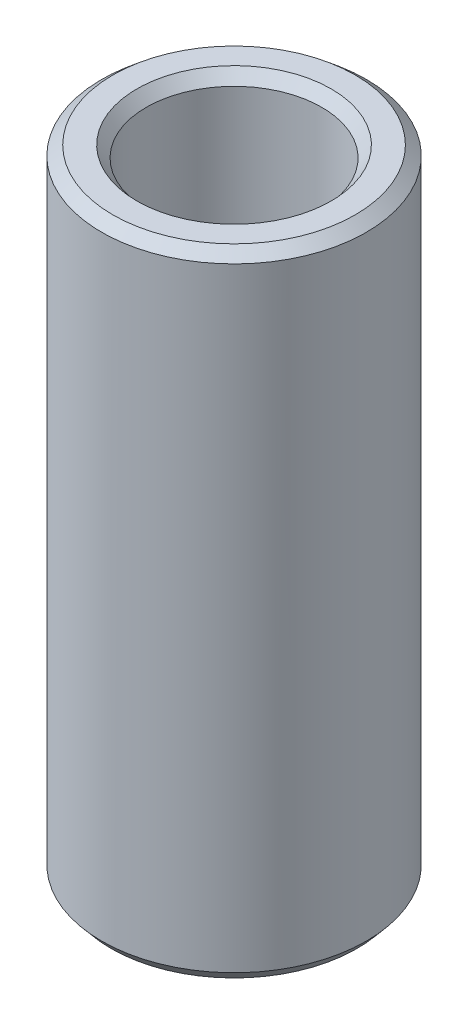
ISO-10303-21;
HEADER;
FILE_DESCRIPTION(('STEP AP214'),'2;1');
FILE_NAME('part.step','',(''),(''),'','','');
FILE_SCHEMA(('AUTOMOTIVE_DESIGN { 1 0 10303 214 1 1 1 1 }'));
ENDSEC;
DATA;
#1=APPLICATION_CONTEXT('core data for automotive mechanical design processes');
#2=APPLICATION_PROTOCOL_DEFINITION('international standard','automotive_design',2000,#1);
#3=PRODUCT_CONTEXT('',#1,'mechanical');
#4=PRODUCT('Part','Part','',(#3));
#5=PRODUCT_RELATED_PRODUCT_CATEGORY('part','',(#4));
#6=PRODUCT_DEFINITION_FORMATION('','',#4);
#7=PRODUCT_DEFINITION_CONTEXT('part definition',#1,'design');
#8=PRODUCT_DEFINITION('design','',#6,#7);
#9=PRODUCT_DEFINITION_SHAPE('','',#8);
#10=(LENGTH_UNIT() NAMED_UNIT(*) SI_UNIT(.MILLI.,.METRE.));
#11=(NAMED_UNIT(*) PLANE_ANGLE_UNIT() SI_UNIT($,.RADIAN.));
#12=(NAMED_UNIT(*) SI_UNIT($,.STERADIAN.) SOLID_ANGLE_UNIT());
#13=UNCERTAINTY_MEASURE_WITH_UNIT(LENGTH_MEASURE(1.E-05),#10,'distance_accuracy_value','');
#14=(GEOMETRIC_REPRESENTATION_CONTEXT(3) GLOBAL_UNCERTAINTY_ASSIGNED_CONTEXT((#13)) GLOBAL_UNIT_ASSIGNED_CONTEXT((#10,
#11,#12)) REPRESENTATION_CONTEXT('',''));
#15=CARTESIAN_POINT('',(0.,0.,0.));
#16=DIRECTION('',(0.,0.,1.));
#17=DIRECTION('',(1.,0.,0.));
#18=AXIS2_PLACEMENT_3D('',#15,#16,#17);
#19=CARTESIAN_POINT('',(0.,239.631027816616,0.));
#20=DIRECTION('',(0.,-1.,0.));
#21=DIRECTION('',(0.,0.,-1.));
#22=AXIS2_PLACEMENT_3D('',#19,#20,#21);
#23=CYLINDRICAL_SURFACE('',#22,50.);
#24=CARTESIAN_POINT('',(0.,4.23667000761427,0.));
#25=DIRECTION('',(0.,1.,0.));
#26=DIRECTION('',(0.,0.,1.));
#27=AXIS2_PLACEMENT_3D('',#24,#25,#26);
#28=CIRCLE('',#27,50.);
#29=CARTESIAN_POINT('',(0.,4.23667000761427,50.));
#30=VERTEX_POINT('',#29);
#31=EDGE_CURVE('E10',#30,#30,#28,.T.);
#32=ORIENTED_EDGE('',*,*,#31,.T.);
#33=EDGE_LOOP('',(#32));
#34=FACE_BOUND('',#33,.T.);
#35=CARTESIAN_POINT('',(0.,236.068790785085,0.));
#36=DIRECTION('',(0.,1.,0.));
#37=DIRECTION('',(0.,0.,1.));
#38=AXIS2_PLACEMENT_3D('',#35,#36,#37);
#39=CIRCLE('',#38,50.);
#40=CARTESIAN_POINT('',(0.,236.068790785085,-50.));
#41=VERTEX_POINT('',#40);
#42=EDGE_CURVE('E50',#41,#41,#39,.F.);
#43=ORIENTED_EDGE('',*,*,#42,.T.);
#44=EDGE_LOOP('',(#43));
#45=FACE_BOUND('',#44,.T.);
#46=ADVANCED_FACE('F39',(#34,#45),#23,.T.);
#47=CARTESIAN_POINT('',(0.,239.631027816616,0.));
#48=DIRECTION('',(0.,1.,0.));
#49=DIRECTION('',(0.,0.,1.));
#50=AXIS2_PLACEMENT_3D('',#47,#48,#49);
#51=PLANE('',#50);
#52=CARTESIAN_POINT('',(0.,239.631027816616,0.));
#53=DIRECTION('',(0.,1.,0.));
#54=DIRECTION('',(0.,0.,1.));
#55=AXIS2_PLACEMENT_3D('',#52,#53,#54);
#56=CIRCLE('',#55,36.6933530759226);
#57=CARTESIAN_POINT('',(0.,239.631027816616,36.6933530759226));
#58=VERTEX_POINT('',#57);
#59=EDGE_CURVE('E58',#58,#58,#56,.F.);
#60=ORIENTED_EDGE('',*,*,#59,.T.);
#61=EDGE_LOOP('',(#60));
#62=FACE_BOUND('',#61,.T.);
#63=CARTESIAN_POINT('',(0.,239.631027816616,0.));
#64=DIRECTION('',(0.,1.,0.));
#65=DIRECTION('',(0.,0.,1.));
#66=AXIS2_PLACEMENT_3D('',#63,#64,#65);
#67=CIRCLE('',#66,45.7633299923858);
#68=CARTESIAN_POINT('',(0.,239.631027816616,-45.7633299923858));
#69=VERTEX_POINT('',#68);
#70=EDGE_CURVE('E61',#69,#69,#67,.T.);
#71=ORIENTED_EDGE('',*,*,#70,.T.);
#72=EDGE_LOOP('',(#71));
#73=FACE_BOUND('',#72,.T.);
#74=ADVANCED_FACE('F88',(#62,#73),#51,.T.);
#75=CARTESIAN_POINT('',(0.,0.,0.));
#76=DIRECTION('',(0.,1.,0.));
#77=DIRECTION('',(0.,0.,1.));
#78=AXIS2_PLACEMENT_3D('',#75,#76,#77);
#79=PLANE('',#78);
#80=CARTESIAN_POINT('',(0.,0.,0.));
#81=DIRECTION('',(0.,1.,0.));
#82=DIRECTION('',(0.,0.,1.));
#83=AXIS2_PLACEMENT_3D('',#80,#81,#82);
#84=CIRCLE('',#83,37.3677860520059);
#85=CARTESIAN_POINT('',(0.,0.,37.3677860520059));
#86=VERTEX_POINT('',#85);
#87=EDGE_CURVE('E51',#86,#86,#84,.T.);
#88=ORIENTED_EDGE('',*,*,#87,.T.);
#89=EDGE_LOOP('',(#88));
#90=FACE_BOUND('',#89,.T.);
#91=CARTESIAN_POINT('',(0.,0.,0.));
#92=DIRECTION('',(0.,1.,0.));
#93=DIRECTION('',(0.,0.,1.));
#94=AXIS2_PLACEMENT_3D('',#91,#92,#93);
#95=CIRCLE('',#94,46.437762968469);
#96=CARTESIAN_POINT('',(0.,0.,46.437762968469));
#97=VERTEX_POINT('',#96);
#98=EDGE_CURVE('E54',#97,#97,#95,.F.);
#99=ORIENTED_EDGE('',*,*,#98,.T.);
#100=EDGE_LOOP('',(#99));
#101=FACE_BOUND('',#100,.T.);
#102=ADVANCED_FACE('F83',(#90,#101),#79,.F.);
#103=CARTESIAN_POINT('',(0.,239.631027816616,0.));
#104=DIRECTION('',(0.,-1.,0.));
#105=DIRECTION('',(0.,0.,-1.));
#106=AXIS2_PLACEMENT_3D('',#103,#104,#105);
#107=CYLINDRICAL_SURFACE('',#106,33.1311160443917);
#108=CARTESIAN_POINT('',(0.,235.394357809001,0.));
#109=DIRECTION('',(0.,1.,0.));
#110=DIRECTION('',(0.,0.,1.));
#111=AXIS2_PLACEMENT_3D('',#108,#109,#110);
#112=CIRCLE('',#111,33.1311160443917);
#113=CARTESIAN_POINT('',(0.,235.394357809001,33.1311160443917));
#114=VERTEX_POINT('',#113);
#115=EDGE_CURVE('E67',#114,#114,#112,.T.);
#116=ORIENTED_EDGE('',*,*,#115,.T.);
#117=EDGE_LOOP('',(#116));
#118=FACE_BOUND('',#117,.T.);
#119=CARTESIAN_POINT('',(0.,3.56223703153102,0.));
#120=DIRECTION('',(0.,1.,0.));
#121=DIRECTION('',(0.,0.,1.));
#122=AXIS2_PLACEMENT_3D('',#119,#120,#121);
#123=CIRCLE('',#122,33.1311160443917);
#124=CARTESIAN_POINT('',(0.,3.56223703153102,33.1311160443917));
#125=VERTEX_POINT('',#124);
#126=EDGE_CURVE('E69',#125,#125,#123,.F.);
#127=ORIENTED_EDGE('',*,*,#126,.T.);
#128=EDGE_LOOP('',(#127));
#129=FACE_BOUND('',#128,.T.);
#130=ADVANCED_FACE('F71',(#118,#129),#107,.F.);
#131=CARTESIAN_POINT('',(0.,235.394357809001,0.));
#132=DIRECTION('',(0.,1.,0.));
#133=DIRECTION('',(0.,0.,1.));
#134=AXIS2_PLACEMENT_3D('',#131,#132,#133);
#135=CONICAL_SURFACE('',#134,33.1311160443917,0.699134890297728);
#136=ORIENTED_EDGE('',*,*,#59,.F.);
#137=EDGE_LOOP('',(#136));
#138=FACE_BOUND('',#137,.T.);
#139=ORIENTED_EDGE('',*,*,#115,.F.);
#140=EDGE_LOOP('',(#139));
#141=FACE_BOUND('',#140,.T.);
#142=ADVANCED_FACE('F77',(#138,#141),#135,.F.);
#143=CARTESIAN_POINT('',(0.,0.,0.));
#144=DIRECTION('',(0.,-1.,0.));
#145=DIRECTION('',(0.,0.,-1.));
#146=AXIS2_PLACEMENT_3D('',#143,#144,#145);
#147=CONICAL_SURFACE('',#146,37.3677860520059,0.871661436497165);
#148=ORIENTED_EDGE('',*,*,#126,.F.);
#149=EDGE_LOOP('',(#148));
#150=FACE_BOUND('',#149,.T.);
#151=ORIENTED_EDGE('',*,*,#87,.F.);
#152=EDGE_LOOP('',(#151));
#153=FACE_BOUND('',#152,.T.);
#154=ADVANCED_FACE('F73',(#150,#153),#147,.F.);
#155=CARTESIAN_POINT('',(0.,4.23667000761427,0.));
#156=DIRECTION('',(0.,1.,0.));
#157=DIRECTION('',(0.,0.,1.));
#158=AXIS2_PLACEMENT_3D('',#155,#156,#157);
#159=CONICAL_SURFACE('',#158,50.,0.699134890297727);
#160=ORIENTED_EDGE('',*,*,#98,.F.);
#161=EDGE_LOOP('',(#160));
#162=FACE_BOUND('',#161,.T.);
#163=ORIENTED_EDGE('',*,*,#31,.F.);
#164=EDGE_LOOP('',(#163));
#165=FACE_BOUND('',#164,.T.);
#166=ADVANCED_FACE('F76',(#162,#165),#159,.T.);
#167=CARTESIAN_POINT('',(0.,239.631027816616,0.));
#168=DIRECTION('',(0.,-1.,0.));
#169=DIRECTION('',(0.,0.,-1.));
#170=AXIS2_PLACEMENT_3D('',#167,#168,#169);
#171=CONICAL_SURFACE('',#170,45.7633299923858,0.871661436497164);
#172=CARTESIAN_POINT('',(0.,236.068790785085,-50.));
#173=CARTESIAN_POINT('',(0.,236.10589742083,-49.955868020754));
#174=CARTESIAN_POINT('',(0.,236.143004056575,-49.911736041508));
#175=CARTESIAN_POINT('',(0.,236.217217328065,-49.8234720830161));
#176=CARTESIAN_POINT('',(0.,236.25432396381,-49.7793401037701));
#177=CARTESIAN_POINT('',(0.,236.328537235301,-49.6910761452782));
#178=CARTESIAN_POINT('',(0.,236.365643871046,-49.6469441660322));
#179=CARTESIAN_POINT('',(0.,236.439857142536,-49.5586802075402));
#180=CARTESIAN_POINT('',(0.,236.476963778281,-49.5145482282942));
#181=CARTESIAN_POINT('',(0.,236.551177049771,-49.4262842698023));
#182=CARTESIAN_POINT('',(0.,236.588283685516,-49.3821522905563));
#183=CARTESIAN_POINT('',(0.,236.662496957007,-49.2938883320643));
#184=CARTESIAN_POINT('',(0.,236.699603592752,-49.2497563528183));
#185=CARTESIAN_POINT('',(0.,236.773816864242,-49.1614923943264));
#186=CARTESIAN_POINT('',(0.,236.810923499987,-49.1173604150804));
#187=CARTESIAN_POINT('',(0.,236.885136771477,-49.0290964565884));
#188=CARTESIAN_POINT('',(0.,236.922243407222,-48.9849644773425));
#189=CARTESIAN_POINT('',(0.,236.996456678713,-48.8967005188505));
#190=CARTESIAN_POINT('',(0.,237.033563314458,-48.8525685396045));
#191=CARTESIAN_POINT('',(0.,237.107776585948,-48.7643045811126));
#192=CARTESIAN_POINT('',(0.,237.144883221693,-48.7201726018666));
#193=CARTESIAN_POINT('',(0.,237.219096493183,-48.6319086433746));
#194=CARTESIAN_POINT('',(0.,237.256203128928,-48.5877766641286));
#195=CARTESIAN_POINT('',(0.,237.330416400419,-48.4995127056367));
#196=CARTESIAN_POINT('',(0.,237.367523036164,-48.4553807263907));
#197=CARTESIAN_POINT('',(0.,237.441736307654,-48.3671167678987));
#198=CARTESIAN_POINT('',(0.,237.478842943399,-48.3229847886527));
#199=CARTESIAN_POINT('',(0.,237.553056214889,-48.2347208301608));
#200=CARTESIAN_POINT('',(0.,237.590162850634,-48.1905888509148));
#201=CARTESIAN_POINT('',(0.,237.664376122125,-48.1023248924228));
#202=CARTESIAN_POINT('',(0.,237.70148275787,-48.0581929131769));
#203=CARTESIAN_POINT('',(0.,237.77569602936,-47.9699289546849));
#204=CARTESIAN_POINT('',(0.,237.812802665105,-47.9257969754389));
#205=CARTESIAN_POINT('',(0.,237.887015936595,-47.8375330169469));
#206=CARTESIAN_POINT('',(0.,237.92412257234,-47.793401037701));
#207=CARTESIAN_POINT('',(0.,237.998335843831,-47.705137079209));
#208=CARTESIAN_POINT('',(0.,238.035442479576,-47.661005099963));
#209=CARTESIAN_POINT('',(0.,238.109655751066,-47.5727411414711));
#210=CARTESIAN_POINT('',(0.,238.146762386811,-47.5286091622251));
#211=CARTESIAN_POINT('',(0.,238.220975658301,-47.4403452037331));
#212=CARTESIAN_POINT('',(0.,238.258082294046,-47.3962132244871));
#213=CARTESIAN_POINT('',(0.,238.332295565537,-47.3079492659952));
#214=CARTESIAN_POINT('',(0.,238.369402201282,-47.2638172867492));
#215=CARTESIAN_POINT('',(0.,238.443615472772,-47.1755533282572));
#216=CARTESIAN_POINT('',(0.,238.480722108517,-47.1314213490113));
#217=CARTESIAN_POINT('',(0.,238.554935380007,-47.0431573905193));
#218=CARTESIAN_POINT('',(0.,238.592042015752,-46.9990254112733));
#219=CARTESIAN_POINT('',(0.,238.666255287243,-46.9107614527814));
#220=CARTESIAN_POINT('',(0.,238.703361922988,-46.8666294735354));
#221=CARTESIAN_POINT('',(0.,238.777575194478,-46.7783655150434));
#222=CARTESIAN_POINT('',(0.,238.814681830223,-46.7342335357974));
#223=CARTESIAN_POINT('',(0.,238.888895101713,-46.6459695773055));
#224=CARTESIAN_POINT('',(0.,238.926001737459,-46.6018375980595));
#225=CARTESIAN_POINT('',(0.,239.000215008949,-46.5135736395675));
#226=CARTESIAN_POINT('',(0.,239.037321644694,-46.4694416603215));
#227=CARTESIAN_POINT('',(0.,239.111534916184,-46.3811777018296));
#228=CARTESIAN_POINT('',(0.,239.148641551929,-46.3370457225836));
#229=CARTESIAN_POINT('',(0.,239.222854823419,-46.2487817640916));
#230=CARTESIAN_POINT('',(0.,239.259961459165,-46.2046497848457));
#231=CARTESIAN_POINT('',(0.,239.334174730655,-46.1163858263537));
#232=CARTESIAN_POINT('',(0.,239.3712813664,-46.0722538471077));
#233=CARTESIAN_POINT('',(0.,239.44549463789,-45.9839898886158));
#234=CARTESIAN_POINT('',(0.,239.482601273635,-45.9398579093698));
#235=CARTESIAN_POINT('',(0.,239.556814545125,-45.8515939508778));
#236=CARTESIAN_POINT('',(0.,239.593921180871,-45.8074619716318));
#237=CARTESIAN_POINT('',(0.,239.631027816616,-45.7633299923858));
#238=B_SPLINE_CURVE_WITH_KNOTS('',3,(#172,#173,#174,#175,#176,#177,#178,#179,#180,#181,#182,
#183,#184,#185,#186,#187,#188,#189,#190,#191,#192,#193,#194,#195,#196,#197,#198,#199,#200,#201,
#202,#203,#204,#205,#206,#207,#208,#209,#210,#211,#212,#213,#214,#215,#216,#217,#218,#219,#220,
#221,#222,#223,#224,#225,#226,#227,#228,#229,#230,#231,#232,#233,#234,#235,#236,#237),
.UNSPECIFIED.,.F.,.F.,(4,2,2,2,2,2,2,2,2,2,2,2,2,2,2,2,2,2,2,2,2,2,2,2,2,2,2,2,2,2,2,2,4),(0.,
0.172976316518749,0.345952633037497,0.51892894955624,0.691905266074989,0.864881582593737,
1.03785789911249,1.21083421563123,1.38381053214998,1.55678684866873,1.72976316518748,
1.90273948170623,2.07571579822498,2.24869211474373,2.42166843126247,2.59464474778122,
2.76762106429999,2.94059738081874,3.11357369733748,3.28655001385623,3.45952633037498,
3.63250264689373,3.80547896341248,3.97845527993123,4.15143159644997,4.32440791296872,
4.49738422948747,4.67036054600622,4.84333686252497,5.01631317904372,5.18928949556247,
5.36226581208122,5.53524212859998),.UNSPECIFIED.);
#239=EDGE_CURVE('BSEAM45',#41,#69,#238,.T.);
#240=ORIENTED_EDGE('',*,*,#42,.F.);
#241=ORIENTED_EDGE('',*,*,#70,.F.);
#242=ORIENTED_EDGE('',*,*,#239,.T.);
#243=ORIENTED_EDGE('',*,*,#239,.F.);
#244=EDGE_LOOP('',(#240,#242,#241,#243));
#245=FACE_BOUND('',#244,.T.);
#246=ADVANCED_FACE('F45',(#245),#171,.T.);
#247=CLOSED_SHELL('',(#46,#74,#102,#130,#142,#154,#166,#246));
#248=MANIFOLD_SOLID_BREP('B2',#247);
#249=ADVANCED_BREP_SHAPE_REPRESENTATION('',(#18,#248),#14);
#250=SHAPE_DEFINITION_REPRESENTATION(#9,#249);
ENDSEC;
END-ISO-10303-21;
